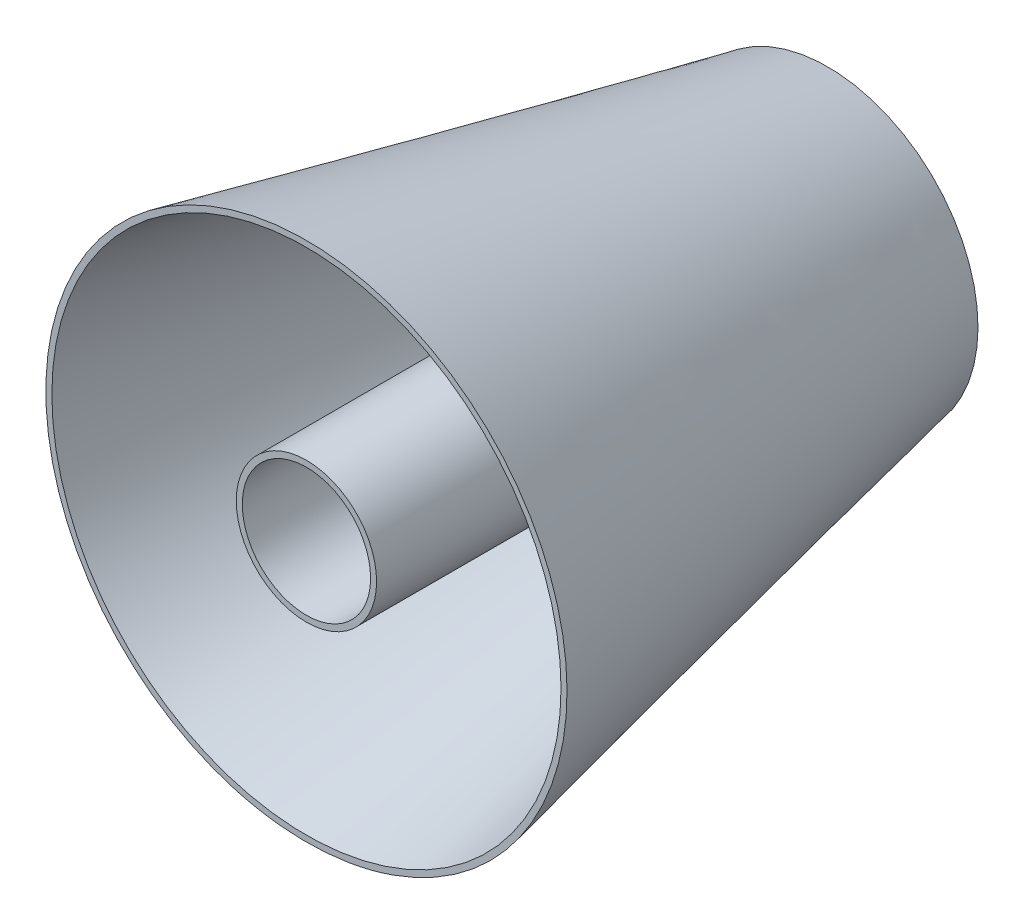
ISO-10303-21;
HEADER;
FILE_DESCRIPTION(('STEP AP214'),'2;1');
FILE_NAME('part.step','',(''),(''),'','','');
FILE_SCHEMA(('AUTOMOTIVE_DESIGN { 1 0 10303 214 1 1 1 1 }'));
ENDSEC;
DATA;
#1=APPLICATION_CONTEXT('core data for automotive mechanical design processes');
#2=APPLICATION_PROTOCOL_DEFINITION('international standard','automotive_design',2000,#1);
#3=PRODUCT_CONTEXT('',#1,'mechanical');
#4=PRODUCT('Part','Part','',(#3));
#5=PRODUCT_RELATED_PRODUCT_CATEGORY('part','',(#4));
#6=PRODUCT_DEFINITION_FORMATION('','',#4);
#7=PRODUCT_DEFINITION_CONTEXT('part definition',#1,'design');
#8=PRODUCT_DEFINITION('design','',#6,#7);
#9=PRODUCT_DEFINITION_SHAPE('','',#8);
#10=(LENGTH_UNIT() NAMED_UNIT(*) SI_UNIT(.MILLI.,.METRE.));
#11=(NAMED_UNIT(*) PLANE_ANGLE_UNIT() SI_UNIT($,.RADIAN.));
#12=(NAMED_UNIT(*) SI_UNIT($,.STERADIAN.) SOLID_ANGLE_UNIT());
#13=UNCERTAINTY_MEASURE_WITH_UNIT(LENGTH_MEASURE(1.E-05),#10,'distance_accuracy_value','');
#14=(GEOMETRIC_REPRESENTATION_CONTEXT(3) GLOBAL_UNCERTAINTY_ASSIGNED_CONTEXT((#13)) GLOBAL_UNIT_ASSIGNED_CONTEXT((#10,
#11,#12)) REPRESENTATION_CONTEXT('',''));
#15=CARTESIAN_POINT('',(0.,0.,0.));
#16=DIRECTION('',(0.,0.,1.));
#17=DIRECTION('',(1.,0.,0.));
#18=AXIS2_PLACEMENT_3D('',#15,#16,#17);
#19=CARTESIAN_POINT('',(0.,0.,3.));
#20=DIRECTION('',(0.,0.,-1.));
#21=DIRECTION('',(-1.,0.,0.));
#22=AXIS2_PLACEMENT_3D('',#19,#20,#21);
#23=PLANE('',#22);
#24=CARTESIAN_POINT('',(0.,0.,3.));
#25=DIRECTION('',(0.,0.,-1.));
#26=DIRECTION('',(-1.,0.,0.));
#27=AXIS2_PLACEMENT_3D('',#24,#25,#26);
#28=CIRCLE('',#27,72.6346153846154);
#29=CARTESIAN_POINT('',(-72.6346153846154,0.,3.));
#30=VERTEX_POINT('',#29);
#31=EDGE_CURVE('E44',#30,#30,#28,.F.);
#32=ORIENTED_EDGE('',*,*,#31,.T.);
#33=EDGE_LOOP('',(#32));
#34=FACE_BOUND('',#33,.T.);
#35=CARTESIAN_POINT('',(0.,0.,3.));
#36=DIRECTION('',(0.,0.,-1.));
#37=DIRECTION('',(-1.,0.,0.));
#38=AXIS2_PLACEMENT_3D('',#35,#36,#37);
#39=CIRCLE('',#38,35.);
#40=CARTESIAN_POINT('',(-35.,0.,3.));
#41=VERTEX_POINT('',#40);
#42=EDGE_CURVE('E11',#41,#41,#39,.F.);
#43=ORIENTED_EDGE('',*,*,#42,.F.);
#44=EDGE_LOOP('',(#43));
#45=FACE_BOUND('',#44,.T.);
#46=ADVANCED_FACE('F36',(#34,#45),#23,.F.);
#47=CARTESIAN_POINT('',(0.,0.,0.));
#48=DIRECTION('',(0.,0.,1.));
#49=DIRECTION('',(1.,0.,0.));
#50=AXIS2_PLACEMENT_3D('',#47,#48,#49);
#51=CONICAL_SURFACE('',#50,72.,0.208465218379988);
#52=CARTESIAN_POINT('',(0.,0.,260.));
#53=DIRECTION('',(0.,0.,1.));
#54=DIRECTION('',(1.,0.,0.));
#55=AXIS2_PLACEMENT_3D('',#52,#53,#54);
#56=CIRCLE('',#55,127.);
#57=CARTESIAN_POINT('',(127.,0.,260.));
#58=VERTEX_POINT('',#57);
#59=EDGE_CURVE('E59',#58,#58,#56,.T.);
#60=ORIENTED_EDGE('',*,*,#59,.T.);
#61=EDGE_LOOP('',(#60));
#62=FACE_BOUND('',#61,.T.);
#63=ORIENTED_EDGE('',*,*,#31,.F.);
#64=EDGE_LOOP('',(#63));
#65=FACE_BOUND('',#64,.T.);
#66=ADVANCED_FACE('F89',(#62,#65),#51,.F.);
#67=CARTESIAN_POINT('',(0.,0.,0.));
#68=DIRECTION('',(0.,0.,1.));
#69=DIRECTION('',(1.,0.,0.));
#70=AXIS2_PLACEMENT_3D('',#67,#68,#69);
#71=PLANE('',#70);
#72=CARTESIAN_POINT('',(0.,0.,0.));
#73=DIRECTION('',(0.,0.,1.));
#74=DIRECTION('',(1.,0.,0.));
#75=AXIS2_PLACEMENT_3D('',#72,#73,#74);
#76=CIRCLE('',#75,75.);
#77=CARTESIAN_POINT('',(13.3586467698157,73.8007219238355,0.));
#78=VERTEX_POINT('',#77);
#79=EDGE_CURVE('E52',#78,#78,#76,.T.);
#80=ORIENTED_EDGE('',*,*,#79,.F.);
#81=EDGE_LOOP('',(#80));
#82=FACE_BOUND('',#81,.T.);
#83=ADVANCED_FACE('F38',(#82),#71,.F.);
#84=CARTESIAN_POINT('',(0.,0.,260.));
#85=DIRECTION('',(0.,0.,1.));
#86=DIRECTION('',(1.,0.,0.));
#87=AXIS2_PLACEMENT_3D('',#84,#85,#86);
#88=PLANE('',#87);
#89=ORIENTED_EDGE('',*,*,#59,.F.);
#90=EDGE_LOOP('',(#89));
#91=FACE_BOUND('',#90,.T.);
#92=CARTESIAN_POINT('',(0.,0.,260.));
#93=DIRECTION('',(0.,0.,1.));
#94=DIRECTION('',(1.,0.,0.));
#95=AXIS2_PLACEMENT_3D('',#92,#93,#94);
#96=CIRCLE('',#95,130.);
#97=CARTESIAN_POINT('',(-3.83846825847501,129.943319033449,260.));
#98=VERTEX_POINT('',#97);
#99=EDGE_CURVE('E48',#98,#98,#96,.T.);
#100=ORIENTED_EDGE('',*,*,#99,.T.);
#101=EDGE_LOOP('',(#100));
#102=FACE_BOUND('',#101,.T.);
#103=ADVANCED_FACE('F78',(#91,#102),#88,.T.);
#104=CARTESIAN_POINT('',(-3.83846825847501,129.943319033449,260.));
#105=CARTESIAN_POINT('',(13.3586467698157,73.8007219238355,0.));
#106=CARTESIAN_POINT('',(256.048169808423,137.620255550399,260.));
#107=CARTESIAN_POINT('',(160.960090617487,47.083428384204,0.));
#108=CARTESIAN_POINT('',(263.725106325373,-122.266382516499,260.));
#109=CARTESIAN_POINT('',(134.242797077855,-100.518015463467,0.));
#110=CARTESIAN_POINT('',(3.838468258475,-129.943319033449,260.));
#111=CARTESIAN_POINT('',(-13.3586467698157,-73.8007219238355,0.));
#112=CARTESIAN_POINT('',(-256.048169808423,-137.620255550399,260.));
#113=CARTESIAN_POINT('',(-160.960090617487,-47.083428384204,0.));
#114=CARTESIAN_POINT('',(-263.725106325373,122.266382516499,260.));
#115=CARTESIAN_POINT('',(-134.242797077855,100.518015463467,0.));
#116=CARTESIAN_POINT('',(-3.83846825847501,129.943319033449,260.));
#117=CARTESIAN_POINT('',(13.3586467698157,73.8007219238355,0.));
#118=(BOUNDED_SURFACE() B_SPLINE_SURFACE(3,1,((#104,#105),(#106,#107),(#108,#109),(#110,#111),
(#112,#113),(#114,#115),(#116,#117)),.UNSPECIFIED.,.T.,.F.,.F.) B_SPLINE_SURFACE_WITH_KNOTS((4,
3,4),(2,2),(0.,0.5,1.),(0.,1.),
.UNSPECIFIED.) GEOMETRIC_REPRESENTATION_ITEM() RATIONAL_B_SPLINE_SURFACE(((1.,1.),
(0.333333333333333,0.333333333333333),(0.333333333333333,0.333333333333333),(1.,1.),
(0.333333333333333,0.333333333333333),(0.333333333333333,0.333333333333333),(1.,1.))) REPRESENTATION_ITEM('') SURFACE());
#119=CARTESIAN_POINT('',(-3.83846825847501,129.943319033449,260.));
#120=CARTESIAN_POINT('',(-3.65933164359699,129.358500313557,257.291666666667));
#121=CARTESIAN_POINT('',(-3.48019502871896,128.773681593665,254.583333333333));
#122=CARTESIAN_POINT('',(-3.1219217989629,127.604044153882,249.166666666667));
#123=CARTESIAN_POINT('',(-2.94278518408487,127.01922543399,246.458333333333));
#124=CARTESIAN_POINT('',(-2.58451195432881,125.849587994206,241.041666666667));
#125=CARTESIAN_POINT('',(-2.40537533945079,125.264769274314,238.333333333333));
#126=CARTESIAN_POINT('',(-2.04710210969473,124.095131834531,232.916666666667));
#127=CARTESIAN_POINT('',(-1.8679654948167,123.510313114639,230.208333333333));
#128=CARTESIAN_POINT('',(-1.50969226506064,122.340675674855,224.791666666667));
#129=CARTESIAN_POINT('',(-1.33055565018261,121.755856954964,222.083333333333));
#130=CARTESIAN_POINT('',(-0.972282420426557,120.58621951518,216.666666666667));
#131=CARTESIAN_POINT('',(-0.793145805548528,120.001400795288,213.958333333333));
#132=CARTESIAN_POINT('',(-0.434872575792471,118.831763355505,208.541666666667));
#133=CARTESIAN_POINT('',(-0.255735960914442,118.246944635613,205.833333333333));
#134=CARTESIAN_POINT('',(0.102537268841615,117.077307195829,200.416666666667));
#135=CARTESIAN_POINT('',(0.281673883719643,116.492488475937,197.708333333333));
#136=CARTESIAN_POINT('',(0.6399471134757,115.322851036154,192.291666666667));
#137=CARTESIAN_POINT('',(0.819083728353729,114.738032316262,189.583333333333));
#138=CARTESIAN_POINT('',(1.17735695810979,113.568394876478,184.166666666667));
#139=CARTESIAN_POINT('',(1.35649357298781,112.983576156587,181.458333333333));
#140=CARTESIAN_POINT('',(1.71476680274387,111.813938716803,176.041666666667));
#141=CARTESIAN_POINT('',(1.8939034176219,111.229119996911,173.333333333333));
#142=CARTESIAN_POINT('',(2.25217664737796,110.059482557127,167.916666666667));
#143=CARTESIAN_POINT('',(2.43131326225599,109.474663837236,165.208333333333));
#144=CARTESIAN_POINT('',(2.78958649201204,108.305026397452,159.791666666667));
#145=CARTESIAN_POINT('',(2.96872310689007,107.72020767756,157.083333333333));
#146=CARTESIAN_POINT('',(3.32699633664613,106.550570237777,151.666666666667));
#147=CARTESIAN_POINT('',(3.50613295152416,105.965751517885,148.958333333333));
#148=CARTESIAN_POINT('',(3.86440618128021,104.796114078101,143.541666666667));
#149=CARTESIAN_POINT('',(4.04354279615824,104.211295358209,140.833333333333));
#150=CARTESIAN_POINT('',(4.4018160259143,103.041657918426,135.416666666667));
#151=CARTESIAN_POINT('',(4.58095264079233,102.456839198534,132.708333333333));
#152=CARTESIAN_POINT('',(4.93922587054839,101.28720175875,127.291666666667));
#153=CARTESIAN_POINT('',(5.11836248542642,100.702383038859,124.583333333333));
#154=CARTESIAN_POINT('',(5.47663571518247,99.5327455990749,119.166666666667));
#155=CARTESIAN_POINT('',(5.6557723300605,98.9479268791831,116.458333333333));
#156=CARTESIAN_POINT('',(6.01404555981656,97.7782894393995,111.041666666667));
#157=CARTESIAN_POINT('',(6.19318217469459,97.1934707195077,108.333333333333));
#158=CARTESIAN_POINT('',(6.55145540445064,96.0238332797241,102.916666666667));
#159=CARTESIAN_POINT('',(6.73059201932867,95.4390145598323,100.208333333333));
#160=CARTESIAN_POINT('',(7.08886524908473,94.2693771200487,94.7916666666667));
#161=CARTESIAN_POINT('',(7.26800186396276,93.6845584001569,92.0833333333333));
#162=CARTESIAN_POINT('',(7.62627509371882,92.5149209603733,86.6666666666667));
#163=CARTESIAN_POINT('',(7.80541170859684,91.9301022404815,83.9583333333333));
#164=CARTESIAN_POINT('',(8.1636849383529,90.7604648006979,78.5416666666667));
#165=CARTESIAN_POINT('',(8.34282155323093,90.1756460808061,75.8333333333333));
#166=CARTESIAN_POINT('',(8.70109478298699,89.0060086410225,70.4166666666667));
#167=CARTESIAN_POINT('',(8.88023139786502,88.4211899211306,67.7083333333333));
#168=CARTESIAN_POINT('',(9.23850462762107,87.251552481347,62.2916666666667));
#169=CARTESIAN_POINT('',(9.4176412424991,86.6667337614552,59.5833333333333));
#170=CARTESIAN_POINT('',(9.77591447225516,85.4970963216716,54.1666666666667));
#171=CARTESIAN_POINT('',(9.95505108713319,84.9122776017798,51.4583333333333));
#172=CARTESIAN_POINT('',(10.3133243168892,83.7426401619962,46.0416666666667));
#173=CARTESIAN_POINT('',(10.4924609317673,83.1578214421044,43.3333333333333));
#174=CARTESIAN_POINT('',(10.8507341615233,81.9881840023208,37.9166666666667));
#175=CARTESIAN_POINT('',(11.0298707764014,81.403365282429,35.2083333333333));
#176=CARTESIAN_POINT('',(11.3881440061574,80.2337278426454,29.7916666666667));
#177=CARTESIAN_POINT('',(11.5672806210354,79.6489091227536,27.0833333333333));
#178=CARTESIAN_POINT('',(11.9255538507915,78.47927168297,21.6666666666667));
#179=CARTESIAN_POINT('',(12.1046904656695,77.8944529630781,18.9583333333333));
#180=CARTESIAN_POINT('',(12.4629636954256,76.7248155232945,13.5416666666667));
#181=CARTESIAN_POINT('',(12.6421003103036,76.1399968034027,10.8333333333333));
#182=CARTESIAN_POINT('',(13.0003735400597,74.9703593636191,5.41666666666667));
#183=CARTESIAN_POINT('',(13.1795101549377,74.3855406437273,2.70833333333333));
#184=CARTESIAN_POINT('',(13.3586467698157,73.8007219238355,0.));
#185=B_SPLINE_CURVE_WITH_KNOTS('',3,(#119,#120,#121,#122,#123,#124,#125,#126,#127,#128,#129,
#130,#131,#132,#133,#134,#135,#136,#137,#138,#139,#140,#141,#142,#143,#144,#145,#146,#147,#148,
#149,#150,#151,#152,#153,#154,#155,#156,#157,#158,#159,#160,#161,#162,#163,#164,#165,#166,#167,
#168,#169,#170,#171,#172,#173,#174,#175,#176,#177,#178,#179,#180,#181,#182,#183,#184),
.UNSPECIFIED.,.F.,.F.,(4,2,2,2,2,2,2,2,2,2,2,2,2,2,2,2,2,2,2,2,2,2,2,2,2,2,2,2,2,2,2,2,4),(0.,
8.32961888427871,16.6592377685574,24.9888566528362,33.3184755371149,41.6480944213936,
49.9777133056723,58.307332189951,66.6369510742297,74.9665699585084,83.2961888427872,
91.6258077270659,99.9554266113446,108.285045495623,116.614664379902,124.944283264181,
133.27390214846,141.603521032738,149.933139917017,158.262758801296,166.592377685574,
174.921996569853,183.251615454132,191.581234338411,199.910853222689,208.240472106968,
216.570090991247,224.899709875525,233.229328759804,241.558947644083,249.888566528362,
258.21818541264,266.547804296919),.UNSPECIFIED.);
#186=EDGE_CURVE('BSEAM87',#98,#78,#185,.T.);
#187=ORIENTED_EDGE('',*,*,#99,.F.);
#188=ORIENTED_EDGE('',*,*,#79,.T.);
#189=ORIENTED_EDGE('',*,*,#186,.T.);
#190=ORIENTED_EDGE('',*,*,#186,.F.);
#191=EDGE_LOOP('',(#187,#189,#188,#190));
#192=FACE_BOUND('',#191,.T.);
#193=ADVANCED_FACE('F87',(#192),#118,.T.);
#194=CARTESIAN_POINT('',(0.,0.,260.));
#195=DIRECTION('',(0.,0.,1.));
#196=DIRECTION('',(1.,0.,0.));
#197=AXIS2_PLACEMENT_3D('',#194,#195,#196);
#198=PLANE('',#197);
#199=CARTESIAN_POINT('',(0.,0.,260.));
#200=DIRECTION('',(0.,0.,1.));
#201=DIRECTION('',(1.,0.,0.));
#202=AXIS2_PLACEMENT_3D('',#199,#200,#201);
#203=CIRCLE('',#202,35.);
#204=CARTESIAN_POINT('',(35.,0.,260.));
#205=VERTEX_POINT('',#204);
#206=EDGE_CURVE('E125',#205,#205,#203,.T.);
#207=ORIENTED_EDGE('',*,*,#206,.T.);
#208=EDGE_LOOP('',(#207));
#209=FACE_BOUND('',#208,.T.);
#210=CARTESIAN_POINT('',(0.,0.,260.));
#211=DIRECTION('',(0.,0.,1.));
#212=DIRECTION('',(1.,0.,0.));
#213=AXIS2_PLACEMENT_3D('',#210,#211,#212);
#214=CIRCLE('',#213,32.);
#215=CARTESIAN_POINT('',(32.,0.,260.));
#216=VERTEX_POINT('',#215);
#217=EDGE_CURVE('E128',#216,#216,#214,.T.);
#218=ORIENTED_EDGE('',*,*,#217,.F.);
#219=EDGE_LOOP('',(#218));
#220=FACE_BOUND('',#219,.T.);
#221=ADVANCED_FACE('F95',(#209,#220),#198,.T.);
#222=CARTESIAN_POINT('',(0.,0.,260.));
#223=DIRECTION('',(0.,0.,-1.));
#224=DIRECTION('',(-1.,0.,0.));
#225=AXIS2_PLACEMENT_3D('',#222,#223,#224);
#226=CYLINDRICAL_SURFACE('',#225,35.);
#227=ORIENTED_EDGE('',*,*,#206,.F.);
#228=EDGE_LOOP('',(#227));
#229=FACE_BOUND('',#228,.T.);
#230=ORIENTED_EDGE('',*,*,#42,.T.);
#231=EDGE_LOOP('',(#230));
#232=FACE_BOUND('',#231,.T.);
#233=ADVANCED_FACE('F139',(#229,#232),#226,.T.);
#234=CARTESIAN_POINT('',(0.,0.,260.));
#235=DIRECTION('',(0.,0.,-1.));
#236=DIRECTION('',(-1.,0.,0.));
#237=AXIS2_PLACEMENT_3D('',#234,#235,#236);
#238=CYLINDRICAL_SURFACE('',#237,32.);
#239=ORIENTED_EDGE('',*,*,#217,.T.);
#240=EDGE_LOOP('',(#239));
#241=FACE_BOUND('',#240,.T.);
#242=CARTESIAN_POINT('',(0.,0.,3.));
#243=DIRECTION('',(0.,0.,1.));
#244=DIRECTION('',(1.,0.,0.));
#245=AXIS2_PLACEMENT_3D('',#242,#243,#244);
#246=CIRCLE('',#245,32.);
#247=CARTESIAN_POINT('',(32.,0.,3.));
#248=VERTEX_POINT('',#247);
#249=EDGE_CURVE('E129',#248,#248,#246,.T.);
#250=ORIENTED_EDGE('',*,*,#249,.F.);
#251=EDGE_LOOP('',(#250));
#252=FACE_BOUND('',#251,.T.);
#253=ADVANCED_FACE('F135',(#241,#252),#238,.F.);
#254=ORIENTED_EDGE('',*,*,#249,.T.);
#255=EDGE_LOOP('',(#254));
#256=FACE_BOUND('',#255,.T.);
#257=ADVANCED_FACE('F149',(#256),#23,.F.);
#258=CLOSED_SHELL('',(#46,#66,#83,#103,#193,#221,#233,#253,#257));
#259=MANIFOLD_SOLID_BREP('B2',#258);
#260=ADVANCED_BREP_SHAPE_REPRESENTATION('',(#18,#259),#14);
#261=SHAPE_DEFINITION_REPRESENTATION(#9,#260);
ENDSEC;
END-ISO-10303-21;
